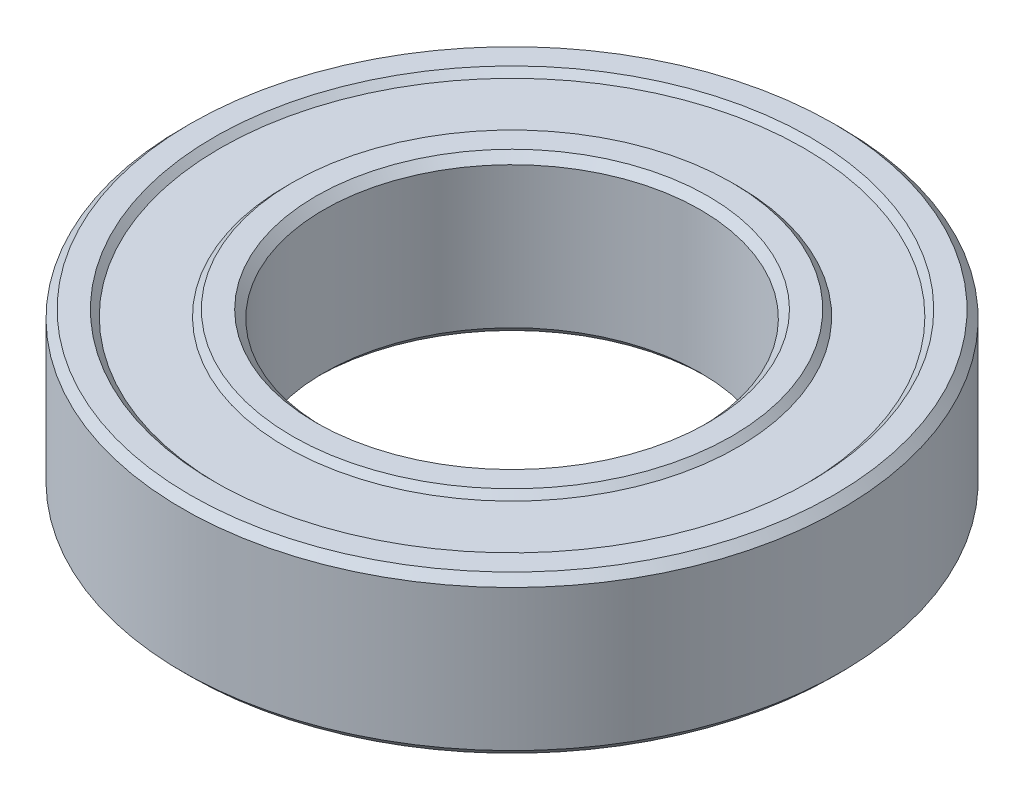
ISO-10303-21;
HEADER;
FILE_DESCRIPTION(('STEP AP214'),'2;1');
FILE_NAME('part.step','',(''),(''),'','','');
FILE_SCHEMA(('AUTOMOTIVE_DESIGN { 1 0 10303 214 1 1 1 1 }'));
ENDSEC;
DATA;
#1=APPLICATION_CONTEXT('core data for automotive mechanical design processes');
#2=APPLICATION_PROTOCOL_DEFINITION('international standard','automotive_design',2000,#1);
#3=PRODUCT_CONTEXT('',#1,'mechanical');
#4=PRODUCT('Part','Part','',(#3));
#5=PRODUCT_RELATED_PRODUCT_CATEGORY('part','',(#4));
#6=PRODUCT_DEFINITION_FORMATION('','',#4);
#7=PRODUCT_DEFINITION_CONTEXT('part definition',#1,'design');
#8=PRODUCT_DEFINITION('design','',#6,#7);
#9=PRODUCT_DEFINITION_SHAPE('','',#8);
#10=(LENGTH_UNIT() NAMED_UNIT(*) SI_UNIT(.MILLI.,.METRE.));
#11=(NAMED_UNIT(*) PLANE_ANGLE_UNIT() SI_UNIT($,.RADIAN.));
#12=(NAMED_UNIT(*) SI_UNIT($,.STERADIAN.) SOLID_ANGLE_UNIT());
#13=UNCERTAINTY_MEASURE_WITH_UNIT(LENGTH_MEASURE(1.E-05),#10,'distance_accuracy_value','');
#14=(GEOMETRIC_REPRESENTATION_CONTEXT(3) GLOBAL_UNCERTAINTY_ASSIGNED_CONTEXT((#13)) GLOBAL_UNIT_ASSIGNED_CONTEXT((#10,
#11,#12)) REPRESENTATION_CONTEXT('',''));
#15=CARTESIAN_POINT('',(0.,0.,0.));
#16=DIRECTION('',(0.,0.,1.));
#17=DIRECTION('',(1.,0.,0.));
#18=AXIS2_PLACEMENT_3D('',#15,#16,#17);
#19=CARTESIAN_POINT('',(0.,2.5,0.));
#20=DIRECTION('',(0.,1.,0.));
#21=DIRECTION('',(0.,0.,1.));
#22=AXIS2_PLACEMENT_3D('',#19,#20,#21);
#23=CONICAL_SURFACE('',#22,6.25,0.785398163397445);
#24=CARTESIAN_POINT('',(0.,2.25,0.));
#25=DIRECTION('',(0.,-1.,0.));
#26=DIRECTION('',(0.,0.,-1.));
#27=AXIS2_PLACEMENT_3D('',#24,#25,#26);
#28=CIRCLE('',#27,6.);
#29=CARTESIAN_POINT('',(0.,2.25,-6.));
#30=VERTEX_POINT('',#29);
#31=EDGE_CURVE('E10',#30,#30,#28,.T.);
#32=ORIENTED_EDGE('',*,*,#31,.T.);
#33=EDGE_LOOP('',(#32));
#34=FACE_BOUND('',#33,.T.);
#35=CARTESIAN_POINT('',(0.,2.5,0.));
#36=DIRECTION('',(0.,-1.,0.));
#37=DIRECTION('',(0.,0.,-1.));
#38=AXIS2_PLACEMENT_3D('',#35,#36,#37);
#39=CIRCLE('',#38,6.25);
#40=CARTESIAN_POINT('',(0.,2.5,-6.25));
#41=VERTEX_POINT('',#40);
#42=EDGE_CURVE('E89',#41,#41,#39,.T.);
#43=ORIENTED_EDGE('',*,*,#42,.F.);
#44=EDGE_LOOP('',(#43));
#45=FACE_BOUND('',#44,.T.);
#46=ADVANCED_FACE('F37',(#34,#45),#23,.F.);
#47=CARTESIAN_POINT('',(0.,-1.34942197217015,0.));
#48=DIRECTION('',(0.,-1.,0.));
#49=DIRECTION('',(0.,0.,-1.));
#50=AXIS2_PLACEMENT_3D('',#47,#48,#49);
#51=CYLINDRICAL_SURFACE('',#50,6.);
#52=CARTESIAN_POINT('',(0.,-2.25,0.));
#53=DIRECTION('',(0.,-1.,0.));
#54=DIRECTION('',(0.,0.,-1.));
#55=AXIS2_PLACEMENT_3D('',#52,#53,#54);
#56=CIRCLE('',#55,6.);
#57=CARTESIAN_POINT('',(0.,-2.25,-6.));
#58=VERTEX_POINT('',#57);
#59=EDGE_CURVE('E43',#58,#58,#56,.T.);
#60=ORIENTED_EDGE('',*,*,#59,.T.);
#61=EDGE_LOOP('',(#60));
#62=FACE_BOUND('',#61,.T.);
#63=ORIENTED_EDGE('',*,*,#31,.F.);
#64=EDGE_LOOP('',(#63));
#65=FACE_BOUND('',#64,.T.);
#66=ADVANCED_FACE('F97',(#62,#65),#51,.F.);
#67=CARTESIAN_POINT('',(0.,-2.25,0.));
#68=DIRECTION('',(0.,-1.,0.));
#69=DIRECTION('',(0.,0.,-1.));
#70=AXIS2_PLACEMENT_3D('',#67,#68,#69);
#71=CONICAL_SURFACE('',#70,6.,0.785398163397451);
#72=CARTESIAN_POINT('',(0.,-2.5,0.));
#73=DIRECTION('',(0.,-1.,0.));
#74=DIRECTION('',(0.,0.,-1.));
#75=AXIS2_PLACEMENT_3D('',#72,#73,#74);
#76=CIRCLE('',#75,6.25);
#77=CARTESIAN_POINT('',(0.,-2.5,-6.25));
#78=VERTEX_POINT('',#77);
#79=EDGE_CURVE('E47',#78,#78,#76,.T.);
#80=ORIENTED_EDGE('',*,*,#79,.T.);
#81=EDGE_LOOP('',(#80));
#82=FACE_BOUND('',#81,.T.);
#83=ORIENTED_EDGE('',*,*,#59,.F.);
#84=EDGE_LOOP('',(#83));
#85=FACE_BOUND('',#84,.T.);
#86=ADVANCED_FACE('F101',(#82,#85),#71,.F.);
#87=CARTESIAN_POINT('',(6.25,-2.5,0.));
#88=DIRECTION('',(0.,-1.,0.));
#89=DIRECTION('',(0.,0.,-1.));
#90=AXIS2_PLACEMENT_3D('',#87,#88,#89);
#91=PLANE('',#90);
#92=CARTESIAN_POINT('',(0.,-2.5,0.));
#93=DIRECTION('',(0.,-1.,0.));
#94=DIRECTION('',(0.,0.,-1.));
#95=AXIS2_PLACEMENT_3D('',#92,#93,#94);
#96=CIRCLE('',#95,7.);
#97=CARTESIAN_POINT('',(0.,-2.5,-7.));
#98=VERTEX_POINT('',#97);
#99=EDGE_CURVE('E51',#98,#98,#96,.T.);
#100=ORIENTED_EDGE('',*,*,#99,.T.);
#101=EDGE_LOOP('',(#100));
#102=FACE_BOUND('',#101,.T.);
#103=ORIENTED_EDGE('',*,*,#79,.F.);
#104=EDGE_LOOP('',(#103));
#105=FACE_BOUND('',#104,.T.);
#106=ADVANCED_FACE('F105',(#102,#105),#91,.T.);
#107=CARTESIAN_POINT('',(0.,-2.5,0.));
#108=DIRECTION('',(0.,1.,0.));
#109=DIRECTION('',(0.,0.,1.));
#110=AXIS2_PLACEMENT_3D('',#107,#108,#109);
#111=CONICAL_SURFACE('',#110,7.,0.785398163397444);
#112=CARTESIAN_POINT('',(0.,-2.3,0.));
#113=DIRECTION('',(0.,-1.,0.));
#114=DIRECTION('',(0.,0.,-1.));
#115=AXIS2_PLACEMENT_3D('',#112,#113,#114);
#116=CIRCLE('',#115,7.2);
#117=CARTESIAN_POINT('',(0.,-2.3,-7.2));
#118=VERTEX_POINT('',#117);
#119=EDGE_CURVE('E56',#118,#118,#116,.T.);
#120=ORIENTED_EDGE('',*,*,#119,.T.);
#121=EDGE_LOOP('',(#120));
#122=FACE_BOUND('',#121,.T.);
#123=ORIENTED_EDGE('',*,*,#99,.F.);
#124=EDGE_LOOP('',(#123));
#125=FACE_BOUND('',#124,.T.);
#126=ADVANCED_FACE('F112',(#122,#125),#111,.T.);
#127=CARTESIAN_POINT('',(7.2,-2.3,0.));
#128=DIRECTION('',(0.,-1.,0.));
#129=DIRECTION('',(0.,0.,-1.));
#130=AXIS2_PLACEMENT_3D('',#127,#128,#129);
#131=PLANE('',#130);
#132=CARTESIAN_POINT('',(0.,-2.3,0.));
#133=DIRECTION('',(0.,-1.,0.));
#134=DIRECTION('',(0.,0.,-1.));
#135=AXIS2_PLACEMENT_3D('',#132,#133,#134);
#136=CIRCLE('',#135,9.3);
#137=CARTESIAN_POINT('',(0.,-2.3,-9.3));
#138=VERTEX_POINT('',#137);
#139=EDGE_CURVE('E59',#138,#138,#136,.T.);
#140=ORIENTED_EDGE('',*,*,#139,.T.);
#141=EDGE_LOOP('',(#140));
#142=FACE_BOUND('',#141,.T.);
#143=ORIENTED_EDGE('',*,*,#119,.F.);
#144=EDGE_LOOP('',(#143));
#145=FACE_BOUND('',#144,.T.);
#146=ADVANCED_FACE('F116',(#142,#145),#131,.T.);
#147=CARTESIAN_POINT('',(0.,-2.3,0.));
#148=DIRECTION('',(0.,-1.,0.));
#149=DIRECTION('',(0.,0.,-1.));
#150=AXIS2_PLACEMENT_3D('',#147,#148,#149);
#151=CONICAL_SURFACE('',#150,9.3,0.785398163397442);
#152=CARTESIAN_POINT('',(0.,-2.5,0.));
#153=DIRECTION('',(0.,-1.,0.));
#154=DIRECTION('',(0.,0.,-1.));
#155=AXIS2_PLACEMENT_3D('',#152,#153,#154);
#156=CIRCLE('',#155,9.5);
#157=CARTESIAN_POINT('',(0.,-2.5,-9.5));
#158=VERTEX_POINT('',#157);
#159=EDGE_CURVE('E62',#158,#158,#156,.T.);
#160=ORIENTED_EDGE('',*,*,#159,.T.);
#161=EDGE_LOOP('',(#160));
#162=FACE_BOUND('',#161,.T.);
#163=ORIENTED_EDGE('',*,*,#139,.F.);
#164=EDGE_LOOP('',(#163));
#165=FACE_BOUND('',#164,.T.);
#166=ADVANCED_FACE('F120',(#162,#165),#151,.F.);
#167=CARTESIAN_POINT('',(9.5,-2.5,0.));
#168=DIRECTION('',(0.,-1.,0.));
#169=DIRECTION('',(0.,0.,-1.));
#170=AXIS2_PLACEMENT_3D('',#167,#168,#169);
#171=PLANE('',#170);
#172=CARTESIAN_POINT('',(0.,-2.5,0.));
#173=DIRECTION('',(0.,-1.,0.));
#174=DIRECTION('',(0.,0.,-1.));
#175=AXIS2_PLACEMENT_3D('',#172,#173,#174);
#176=CIRCLE('',#175,10.25);
#177=CARTESIAN_POINT('',(0.,-2.5,-10.25));
#178=VERTEX_POINT('',#177);
#179=EDGE_CURVE('E65',#178,#178,#176,.T.);
#180=ORIENTED_EDGE('',*,*,#179,.T.);
#181=EDGE_LOOP('',(#180));
#182=FACE_BOUND('',#181,.T.);
#183=ORIENTED_EDGE('',*,*,#159,.F.);
#184=EDGE_LOOP('',(#183));
#185=FACE_BOUND('',#184,.T.);
#186=ADVANCED_FACE('F124',(#182,#185),#171,.T.);
#187=CARTESIAN_POINT('',(0.,-2.5,0.));
#188=DIRECTION('',(0.,1.,0.));
#189=DIRECTION('',(0.,0.,1.));
#190=AXIS2_PLACEMENT_3D('',#187,#188,#189);
#191=CONICAL_SURFACE('',#190,10.25,0.785398163397451);
#192=CARTESIAN_POINT('',(0.,-2.25,0.));
#193=DIRECTION('',(0.,-1.,0.));
#194=DIRECTION('',(0.,0.,-1.));
#195=AXIS2_PLACEMENT_3D('',#192,#193,#194);
#196=CIRCLE('',#195,10.5);
#197=CARTESIAN_POINT('',(0.,-2.25,-10.5));
#198=VERTEX_POINT('',#197);
#199=EDGE_CURVE('E68',#198,#198,#196,.T.);
#200=ORIENTED_EDGE('',*,*,#199,.T.);
#201=EDGE_LOOP('',(#200));
#202=FACE_BOUND('',#201,.T.);
#203=ORIENTED_EDGE('',*,*,#179,.F.);
#204=EDGE_LOOP('',(#203));
#205=FACE_BOUND('',#204,.T.);
#206=ADVANCED_FACE('F128',(#202,#205),#191,.T.);
#207=CARTESIAN_POINT('',(0.,-1.34942197217015,0.));
#208=DIRECTION('',(0.,-1.,0.));
#209=DIRECTION('',(0.,0.,-1.));
#210=AXIS2_PLACEMENT_3D('',#207,#208,#209);
#211=CYLINDRICAL_SURFACE('',#210,10.5);
#212=CARTESIAN_POINT('',(0.,2.25,0.));
#213=DIRECTION('',(0.,-1.,0.));
#214=DIRECTION('',(0.,0.,-1.));
#215=AXIS2_PLACEMENT_3D('',#212,#213,#214);
#216=CIRCLE('',#215,10.5);
#217=CARTESIAN_POINT('',(0.,2.25,-10.5));
#218=VERTEX_POINT('',#217);
#219=EDGE_CURVE('E71',#218,#218,#216,.T.);
#220=ORIENTED_EDGE('',*,*,#219,.T.);
#221=EDGE_LOOP('',(#220));
#222=FACE_BOUND('',#221,.T.);
#223=ORIENTED_EDGE('',*,*,#199,.F.);
#224=EDGE_LOOP('',(#223));
#225=FACE_BOUND('',#224,.T.);
#226=ADVANCED_FACE('F132',(#222,#225),#211,.T.);
#227=CARTESIAN_POINT('',(0.,2.25,0.));
#228=DIRECTION('',(0.,-1.,0.));
#229=DIRECTION('',(0.,0.,-1.));
#230=AXIS2_PLACEMENT_3D('',#227,#228,#229);
#231=CONICAL_SURFACE('',#230,10.5,0.785398163397452);
#232=CARTESIAN_POINT('',(0.,2.5,0.));
#233=DIRECTION('',(0.,-1.,0.));
#234=DIRECTION('',(0.,0.,-1.));
#235=AXIS2_PLACEMENT_3D('',#232,#233,#234);
#236=CIRCLE('',#235,10.25);
#237=CARTESIAN_POINT('',(0.,2.5,-10.25));
#238=VERTEX_POINT('',#237);
#239=EDGE_CURVE('E74',#238,#238,#236,.T.);
#240=ORIENTED_EDGE('',*,*,#239,.T.);
#241=EDGE_LOOP('',(#240));
#242=FACE_BOUND('',#241,.T.);
#243=ORIENTED_EDGE('',*,*,#219,.F.);
#244=EDGE_LOOP('',(#243));
#245=FACE_BOUND('',#244,.T.);
#246=ADVANCED_FACE('F136',(#242,#245),#231,.T.);
#247=CARTESIAN_POINT('',(10.25,2.5,0.));
#248=DIRECTION('',(0.,1.,0.));
#249=DIRECTION('',(0.,0.,1.));
#250=AXIS2_PLACEMENT_3D('',#247,#248,#249);
#251=PLANE('',#250);
#252=CARTESIAN_POINT('',(0.,2.5,0.));
#253=DIRECTION('',(0.,-1.,0.));
#254=DIRECTION('',(0.,0.,-1.));
#255=AXIS2_PLACEMENT_3D('',#252,#253,#254);
#256=CIRCLE('',#255,9.5);
#257=CARTESIAN_POINT('',(0.,2.5,-9.5));
#258=VERTEX_POINT('',#257);
#259=EDGE_CURVE('E77',#258,#258,#256,.T.);
#260=ORIENTED_EDGE('',*,*,#259,.T.);
#261=EDGE_LOOP('',(#260));
#262=FACE_BOUND('',#261,.T.);
#263=ORIENTED_EDGE('',*,*,#239,.F.);
#264=EDGE_LOOP('',(#263));
#265=FACE_BOUND('',#264,.T.);
#266=ADVANCED_FACE('F140',(#262,#265),#251,.T.);
#267=CARTESIAN_POINT('',(0.,2.5,0.));
#268=DIRECTION('',(0.,1.,0.));
#269=DIRECTION('',(0.,0.,1.));
#270=AXIS2_PLACEMENT_3D('',#267,#268,#269);
#271=CONICAL_SURFACE('',#270,9.5,0.785398163397448);
#272=CARTESIAN_POINT('',(0.,2.3,0.));
#273=DIRECTION('',(0.,-1.,0.));
#274=DIRECTION('',(0.,0.,-1.));
#275=AXIS2_PLACEMENT_3D('',#272,#273,#274);
#276=CIRCLE('',#275,9.3);
#277=CARTESIAN_POINT('',(0.,2.3,-9.3));
#278=VERTEX_POINT('',#277);
#279=EDGE_CURVE('E80',#278,#278,#276,.T.);
#280=ORIENTED_EDGE('',*,*,#279,.T.);
#281=EDGE_LOOP('',(#280));
#282=FACE_BOUND('',#281,.T.);
#283=ORIENTED_EDGE('',*,*,#259,.F.);
#284=EDGE_LOOP('',(#283));
#285=FACE_BOUND('',#284,.T.);
#286=ADVANCED_FACE('F144',(#282,#285),#271,.F.);
#287=CARTESIAN_POINT('',(9.3,2.3,0.));
#288=DIRECTION('',(0.,1.,0.));
#289=DIRECTION('',(0.,0.,1.));
#290=AXIS2_PLACEMENT_3D('',#287,#288,#289);
#291=PLANE('',#290);
#292=CARTESIAN_POINT('',(0.,2.3,0.));
#293=DIRECTION('',(0.,-1.,0.));
#294=DIRECTION('',(0.,0.,-1.));
#295=AXIS2_PLACEMENT_3D('',#292,#293,#294);
#296=CIRCLE('',#295,7.2);
#297=CARTESIAN_POINT('',(0.,2.3,-7.2));
#298=VERTEX_POINT('',#297);
#299=EDGE_CURVE('E83',#298,#298,#296,.T.);
#300=ORIENTED_EDGE('',*,*,#299,.T.);
#301=EDGE_LOOP('',(#300));
#302=FACE_BOUND('',#301,.T.);
#303=ORIENTED_EDGE('',*,*,#279,.F.);
#304=EDGE_LOOP('',(#303));
#305=FACE_BOUND('',#304,.T.);
#306=ADVANCED_FACE('F148',(#302,#305),#291,.T.);
#307=CARTESIAN_POINT('',(0.,2.3,0.));
#308=DIRECTION('',(0.,-1.,0.));
#309=DIRECTION('',(0.,0.,-1.));
#310=AXIS2_PLACEMENT_3D('',#307,#308,#309);
#311=CONICAL_SURFACE('',#310,7.2,0.78539816339745);
#312=CARTESIAN_POINT('',(0.,2.5,0.));
#313=DIRECTION('',(0.,-1.,0.));
#314=DIRECTION('',(0.,0.,-1.));
#315=AXIS2_PLACEMENT_3D('',#312,#313,#314);
#316=CIRCLE('',#315,7.);
#317=CARTESIAN_POINT('',(0.,2.5,-7.));
#318=VERTEX_POINT('',#317);
#319=EDGE_CURVE('E86',#318,#318,#316,.T.);
#320=ORIENTED_EDGE('',*,*,#319,.T.);
#321=EDGE_LOOP('',(#320));
#322=FACE_BOUND('',#321,.T.);
#323=ORIENTED_EDGE('',*,*,#299,.F.);
#324=EDGE_LOOP('',(#323));
#325=FACE_BOUND('',#324,.T.);
#326=ADVANCED_FACE('F152',(#322,#325),#311,.T.);
#327=CARTESIAN_POINT('',(7.,2.5,0.));
#328=DIRECTION('',(0.,1.,0.));
#329=DIRECTION('',(0.,0.,1.));
#330=AXIS2_PLACEMENT_3D('',#327,#328,#329);
#331=PLANE('',#330);
#332=ORIENTED_EDGE('',*,*,#42,.T.);
#333=EDGE_LOOP('',(#332));
#334=FACE_BOUND('',#333,.T.);
#335=ORIENTED_EDGE('',*,*,#319,.F.);
#336=EDGE_LOOP('',(#335));
#337=FACE_BOUND('',#336,.T.);
#338=ADVANCED_FACE('F93',(#334,#337),#331,.T.);
#339=CLOSED_SHELL('',(#46,#66,#86,#106,#126,#146,#166,#186,#206,#226,#246,#266,#286,#306,#326,#338));
#340=MANIFOLD_SOLID_BREP('B2',#339);
#341=ADVANCED_BREP_SHAPE_REPRESENTATION('',(#18,#340),#14);
#342=SHAPE_DEFINITION_REPRESENTATION(#9,#341);
ENDSEC;
END-ISO-10303-21;
